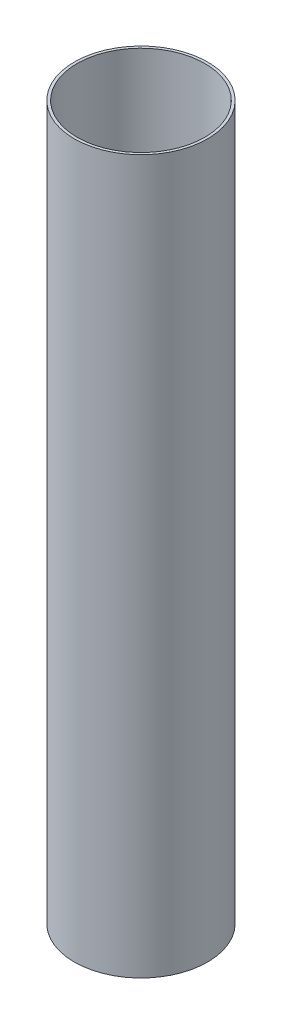
ISO-10303-21;
HEADER;
FILE_DESCRIPTION(('STEP AP214'),'2;1');
FILE_NAME('part.step','',(''),(''),'','','');
FILE_SCHEMA(('AUTOMOTIVE_DESIGN { 1 0 10303 214 1 1 1 1 }'));
ENDSEC;
DATA;
#1=APPLICATION_CONTEXT('core data for automotive mechanical design processes');
#2=APPLICATION_PROTOCOL_DEFINITION('international standard','automotive_design',2000,#1);
#3=PRODUCT_CONTEXT('',#1,'mechanical');
#4=PRODUCT('Part','Part','',(#3));
#5=PRODUCT_RELATED_PRODUCT_CATEGORY('part','',(#4));
#6=PRODUCT_DEFINITION_FORMATION('','',#4);
#7=PRODUCT_DEFINITION_CONTEXT('part definition',#1,'design');
#8=PRODUCT_DEFINITION('design','',#6,#7);
#9=PRODUCT_DEFINITION_SHAPE('','',#8);
#10=(LENGTH_UNIT() NAMED_UNIT(*) SI_UNIT(.MILLI.,.METRE.));
#11=(NAMED_UNIT(*) PLANE_ANGLE_UNIT() SI_UNIT($,.RADIAN.));
#12=(NAMED_UNIT(*) SI_UNIT($,.STERADIAN.) SOLID_ANGLE_UNIT());
#13=UNCERTAINTY_MEASURE_WITH_UNIT(LENGTH_MEASURE(1.E-05),#10,'distance_accuracy_value','');
#14=(GEOMETRIC_REPRESENTATION_CONTEXT(3) GLOBAL_UNCERTAINTY_ASSIGNED_CONTEXT((#13)) GLOBAL_UNIT_ASSIGNED_CONTEXT((#10,
#11,#12)) REPRESENTATION_CONTEXT('',''));
#15=CARTESIAN_POINT('',(0.,0.,0.));
#16=DIRECTION('',(0.,0.,1.));
#17=DIRECTION('',(1.,0.,0.));
#18=AXIS2_PLACEMENT_3D('',#15,#16,#17);
#19=CARTESIAN_POINT('',(0.,304.8,0.));
#20=DIRECTION('',(0.,1.,0.));
#21=DIRECTION('',(0.,0.,1.));
#22=AXIS2_PLACEMENT_3D('',#19,#20,#21);
#23=PLANE('',#22);
#24=CARTESIAN_POINT('',(0.,304.8,0.));
#25=DIRECTION('',(0.,1.,0.));
#26=DIRECTION('',(0.,0.,1.));
#27=AXIS2_PLACEMENT_3D('',#24,#25,#26);
#28=CIRCLE('',#27,28.4734);
#29=CARTESIAN_POINT('',(0.,304.8,28.4734));
#30=VERTEX_POINT('',#29);
#31=EDGE_CURVE('E10',#30,#30,#28,.T.);
#32=ORIENTED_EDGE('',*,*,#31,.T.);
#33=EDGE_LOOP('',(#32));
#34=FACE_BOUND('',#33,.T.);
#35=CARTESIAN_POINT('',(0.,304.8,0.));
#36=DIRECTION('',(0.,1.,0.));
#37=DIRECTION('',(0.,0.,1.));
#38=AXIS2_PLACEMENT_3D('',#35,#36,#37);
#39=CIRCLE('',#38,27.3304);
#40=CARTESIAN_POINT('',(0.,304.8,27.3304));
#41=VERTEX_POINT('',#40);
#42=EDGE_CURVE('E43',#41,#41,#39,.T.);
#43=ORIENTED_EDGE('',*,*,#42,.F.);
#44=EDGE_LOOP('',(#43));
#45=FACE_BOUND('',#44,.T.);
#46=ADVANCED_FACE('F32',(#34,#45),#23,.T.);
#47=CARTESIAN_POINT('',(0.,0.,0.));
#48=DIRECTION('',(0.,1.,0.));
#49=DIRECTION('',(0.,0.,1.));
#50=AXIS2_PLACEMENT_3D('',#47,#48,#49);
#51=PLANE('',#50);
#52=CARTESIAN_POINT('',(0.,0.,0.));
#53=DIRECTION('',(0.,1.,0.));
#54=DIRECTION('',(0.,0.,1.));
#55=AXIS2_PLACEMENT_3D('',#52,#53,#54);
#56=CIRCLE('',#55,28.4734);
#57=CARTESIAN_POINT('',(0.,0.,28.4734));
#58=VERTEX_POINT('',#57);
#59=EDGE_CURVE('E36',#58,#58,#56,.T.);
#60=ORIENTED_EDGE('',*,*,#59,.F.);
#61=EDGE_LOOP('',(#60));
#62=FACE_BOUND('',#61,.T.);
#63=CARTESIAN_POINT('',(0.,0.,0.));
#64=DIRECTION('',(0.,1.,0.));
#65=DIRECTION('',(0.,0.,1.));
#66=AXIS2_PLACEMENT_3D('',#63,#64,#65);
#67=CIRCLE('',#66,27.3304);
#68=CARTESIAN_POINT('',(0.,0.,27.3304));
#69=VERTEX_POINT('',#68);
#70=EDGE_CURVE('E45',#69,#69,#67,.T.);
#71=ORIENTED_EDGE('',*,*,#70,.T.);
#72=EDGE_LOOP('',(#71));
#73=FACE_BOUND('',#72,.T.);
#74=ADVANCED_FACE('F55',(#62,#73),#51,.F.);
#75=CARTESIAN_POINT('',(0.,304.8,0.));
#76=DIRECTION('',(0.,-1.,0.));
#77=DIRECTION('',(0.,0.,-1.));
#78=AXIS2_PLACEMENT_3D('',#75,#76,#77);
#79=CYLINDRICAL_SURFACE('',#78,28.4734);
#80=ORIENTED_EDGE('',*,*,#31,.F.);
#81=EDGE_LOOP('',(#80));
#82=FACE_BOUND('',#81,.T.);
#83=ORIENTED_EDGE('',*,*,#59,.T.);
#84=EDGE_LOOP('',(#83));
#85=FACE_BOUND('',#84,.T.);
#86=ADVANCED_FACE('F34',(#82,#85),#79,.T.);
#87=CARTESIAN_POINT('',(0.,304.8,0.));
#88=DIRECTION('',(0.,-1.,0.));
#89=DIRECTION('',(0.,0.,-1.));
#90=AXIS2_PLACEMENT_3D('',#87,#88,#89);
#91=CYLINDRICAL_SURFACE('',#90,27.3304);
#92=ORIENTED_EDGE('',*,*,#42,.T.);
#93=EDGE_LOOP('',(#92));
#94=FACE_BOUND('',#93,.T.);
#95=ORIENTED_EDGE('',*,*,#70,.F.);
#96=EDGE_LOOP('',(#95));
#97=FACE_BOUND('',#96,.T.);
#98=ADVANCED_FACE('F51',(#94,#97),#91,.F.);
#99=CLOSED_SHELL('',(#46,#74,#86,#98));
#100=MANIFOLD_SOLID_BREP('B2',#99);
#101=ADVANCED_BREP_SHAPE_REPRESENTATION('',(#18,#100),#14);
#102=SHAPE_DEFINITION_REPRESENTATION(#9,#101);
ENDSEC;
END-ISO-10303-21;
